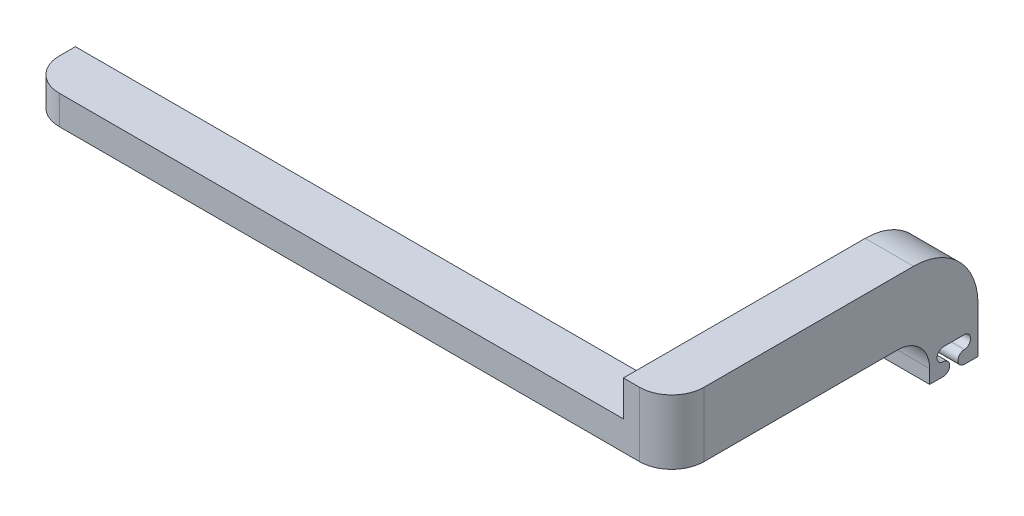
ISO-10303-21;
HEADER;
FILE_DESCRIPTION(('STEP AP214'),'2;1');
FILE_NAME('part.step','',(''),(''),'','','');
FILE_SCHEMA(('AUTOMOTIVE_DESIGN { 1 0 10303 214 1 1 1 1 }'));
ENDSEC;
DATA;
#1=APPLICATION_CONTEXT('core data for automotive mechanical design processes');
#2=APPLICATION_PROTOCOL_DEFINITION('international standard','automotive_design',2000,#1);
#3=PRODUCT_CONTEXT('',#1,'mechanical');
#4=PRODUCT('Part','Part','',(#3));
#5=PRODUCT_RELATED_PRODUCT_CATEGORY('part','',(#4));
#6=PRODUCT_DEFINITION_FORMATION('','',#4);
#7=PRODUCT_DEFINITION_CONTEXT('part definition',#1,'design');
#8=PRODUCT_DEFINITION('design','',#6,#7);
#9=PRODUCT_DEFINITION_SHAPE('','',#8);
#10=(LENGTH_UNIT() NAMED_UNIT(*) SI_UNIT(.MILLI.,.METRE.));
#11=(NAMED_UNIT(*) PLANE_ANGLE_UNIT() SI_UNIT($,.RADIAN.));
#12=(NAMED_UNIT(*) SI_UNIT($,.STERADIAN.) SOLID_ANGLE_UNIT());
#13=UNCERTAINTY_MEASURE_WITH_UNIT(LENGTH_MEASURE(1.E-05),#10,'distance_accuracy_value','');
#14=(GEOMETRIC_REPRESENTATION_CONTEXT(3) GLOBAL_UNCERTAINTY_ASSIGNED_CONTEXT((#13)) GLOBAL_UNIT_ASSIGNED_CONTEXT((#10,
#11,#12)) REPRESENTATION_CONTEXT('',''));
#15=CARTESIAN_POINT('',(0.,0.,0.));
#16=DIRECTION('',(0.,0.,1.));
#17=DIRECTION('',(1.,0.,0.));
#18=AXIS2_PLACEMENT_3D('',#15,#16,#17);
#19=CARTESIAN_POINT('',(-43.083100559231,-15.6274777520744,81.25));
#20=DIRECTION('',(0.,1.,0.));
#21=DIRECTION('',(0.,0.,-1.));
#22=AXIS2_PLACEMENT_3D('',#19,#20,#21);
#23=CYLINDRICAL_SURFACE('',#22,5.);
#24=CARTESIAN_POINT('',(-43.083100559231,-25.6274777520744,81.25));
#25=DIRECTION('',(0.,1.,0.));
#26=DIRECTION('',(0.,0.,1.));
#27=AXIS2_PLACEMENT_3D('',#24,#25,#26);
#28=CIRCLE('',#27,5.);
#29=CARTESIAN_POINT('',(-48.083100559231,-25.6274777520744,81.25));
#30=VERTEX_POINT('',#29);
#31=CARTESIAN_POINT('',(-43.083100559231,-25.6274777520744,86.25));
#32=VERTEX_POINT('',#31);
#33=EDGE_CURVE('E346',#30,#32,#28,.T.);
#34=ORIENTED_EDGE('',*,*,#33,.T.);
#35=DIRECTION('',(0.,1.,0.));
#36=VECTOR('',#35,1.);
#37=CARTESIAN_POINT('',(-43.083100559231,-15.6274777520744,86.25));
#38=LINE('',#37,#36);
#39=CARTESIAN_POINT('',(-43.083100559231,-21.1274777520744,86.25));
#40=VERTEX_POINT('',#39);
#41=EDGE_CURVE('E326',#32,#40,#38,.T.);
#42=ORIENTED_EDGE('',*,*,#41,.T.);
#43=CARTESIAN_POINT('',(-43.083100559231,-21.1274777520744,81.25));
#44=DIRECTION('',(0.,-1.,0.));
#45=DIRECTION('',(0.,0.,-1.));
#46=AXIS2_PLACEMENT_3D('',#43,#44,#45);
#47=CIRCLE('',#46,5.);
#48=CARTESIAN_POINT('',(-48.083100559231,-21.1274777520744,81.25));
#49=VERTEX_POINT('',#48);
#50=EDGE_CURVE('E330',#40,#49,#47,.T.);
#51=ORIENTED_EDGE('',*,*,#50,.T.);
#52=DIRECTION('',(0.,1.,0.));
#53=VECTOR('',#52,1.);
#54=CARTESIAN_POINT('',(-48.083100559231,-21.1274777520744,81.25));
#55=LINE('',#54,#53);
#56=EDGE_CURVE('E334',#49,#30,#55,.F.);
#57=ORIENTED_EDGE('',*,*,#56,.T.);
#58=EDGE_LOOP('',(#34,#42,#51,#57));
#59=FACE_BOUND('',#58,.T.);
#60=ADVANCED_FACE('F43',(#59),#23,.T.);
#61=CARTESIAN_POINT('',(-48.083100559231,-21.1274777520744,78.75));
#62=DIRECTION('',(-1.,0.,0.));
#63=DIRECTION('',(0.,0.,-1.));
#64=AXIS2_PLACEMENT_3D('',#61,#62,#63);
#65=PLANE('',#64);
#66=DIRECTION('',(0.,0.,1.));
#67=VECTOR('',#66,1.);
#68=CARTESIAN_POINT('',(-48.083100559231,-21.1274777520744,78.75));
#69=LINE('',#68,#67);
#70=CARTESIAN_POINT('',(-48.083100559231,-21.1274777520744,78.75));
#71=VERTEX_POINT('',#70);
#72=EDGE_CURVE('E267',#71,#49,#69,.T.);
#73=ORIENTED_EDGE('',*,*,#72,.F.);
#74=DIRECTION('',(0.,1.,0.));
#75=VECTOR('',#74,1.);
#76=CARTESIAN_POINT('',(-48.083100559231,-21.1274777520744,78.75));
#77=LINE('',#76,#75);
#78=CARTESIAN_POINT('',(-48.083100559231,-25.6274777520744,78.75));
#79=VERTEX_POINT('',#78);
#80=EDGE_CURVE('E250',#79,#71,#77,.T.);
#81=ORIENTED_EDGE('',*,*,#80,.F.);
#82=DIRECTION('',(0.,0.,1.));
#83=VECTOR('',#82,1.);
#84=CARTESIAN_POINT('',(-48.083100559231,-25.6274777520744,78.75));
#85=LINE('',#84,#83);
#86=EDGE_CURVE('E258',#79,#30,#85,.T.);
#87=ORIENTED_EDGE('',*,*,#86,.T.);
#88=ORIENTED_EDGE('',*,*,#56,.F.);
#89=EDGE_LOOP('',(#73,#81,#87,#88));
#90=FACE_BOUND('',#89,.T.);
#91=ADVANCED_FACE('F437',(#90),#65,.T.);
#92=CARTESIAN_POINT('',(0.,0.,78.75));
#93=DIRECTION('',(0.,0.,1.));
#94=DIRECTION('',(0.,1.,0.));
#95=AXIS2_PLACEMENT_3D('',#92,#93,#94);
#96=PLANE('',#95);
#97=DIRECTION('',(0.,-1.,0.));
#98=VECTOR('',#97,1.);
#99=CARTESIAN_POINT('',(44.416899440769,-21.1274777520744,78.75));
#100=LINE('',#99,#98);
#101=CARTESIAN_POINT('',(44.416899440769,-21.1274777520744,78.75));
#102=VERTEX_POINT('',#101);
#103=CARTESIAN_POINT('',(44.416899440769,-25.6274777520744,78.75));
#104=VERTEX_POINT('',#103);
#105=EDGE_CURVE('E243',#102,#104,#100,.T.);
#106=ORIENTED_EDGE('',*,*,#105,.T.);
#107=DIRECTION('',(-1.,0.,0.));
#108=VECTOR('',#107,1.);
#109=CARTESIAN_POINT('',(44.416899440769,-25.6274777520744,78.75));
#110=LINE('',#109,#108);
#111=EDGE_CURVE('E247',#104,#79,#110,.T.);
#112=ORIENTED_EDGE('',*,*,#111,.T.);
#113=ORIENTED_EDGE('',*,*,#80,.T.);
#114=DIRECTION('',(1.,0.,0.));
#115=VECTOR('',#114,1.);
#116=CARTESIAN_POINT('',(44.416899440769,-21.1274777520744,78.75));
#117=LINE('',#116,#115);
#118=EDGE_CURVE('E254',#71,#102,#117,.T.);
#119=ORIENTED_EDGE('',*,*,#118,.T.);
#120=EDGE_LOOP('',(#106,#112,#113,#119));
#121=FACE_BOUND('',#120,.T.);
#122=ADVANCED_FACE('F443',(#121),#96,.F.);
#123=CARTESIAN_POINT('',(44.416899440769,-21.1274777520744,78.75));
#124=DIRECTION('',(0.,1.,0.));
#125=DIRECTION('',(0.,0.,-1.));
#126=AXIS2_PLACEMENT_3D('',#123,#124,#125);
#127=PLANE('',#126);
#128=DIRECTION('',(1.,0.,0.));
#129=VECTOR('',#128,1.);
#130=CARTESIAN_POINT('',(44.416899440769,-21.1274777520744,86.25));
#131=LINE('',#130,#129);
#132=CARTESIAN_POINT('',(44.416899440769,-21.1274777520744,86.25));
#133=VERTEX_POINT('',#132);
#134=EDGE_CURVE('E242',#40,#133,#131,.T.);
#135=ORIENTED_EDGE('',*,*,#134,.T.);
#136=DIRECTION('',(0.,0.,1.));
#137=VECTOR('',#136,1.);
#138=CARTESIAN_POINT('',(44.416899440769,-21.1274777520744,78.75));
#139=LINE('',#138,#137);
#140=EDGE_CURVE('E262',#102,#133,#139,.T.);
#141=ORIENTED_EDGE('',*,*,#140,.F.);
#142=ORIENTED_EDGE('',*,*,#118,.F.);
#143=ORIENTED_EDGE('',*,*,#72,.T.);
#144=ORIENTED_EDGE('',*,*,#50,.F.);
#145=EDGE_LOOP('',(#135,#141,#142,#143,#144));
#146=FACE_BOUND('',#145,.T.);
#147=ADVANCED_FACE('F459',(#146),#127,.T.);
#148=CARTESIAN_POINT('',(44.416899440769,-15.6274777520744,86.25));
#149=DIRECTION('',(0.,0.,1.));
#150=DIRECTION('',(0.,1.,0.));
#151=AXIS2_PLACEMENT_3D('',#148,#149,#150);
#152=PLANE('',#151);
#153=DIRECTION('',(1.,0.,0.));
#154=VECTOR('',#153,1.);
#155=CARTESIAN_POINT('',(44.416899440769,-25.6274777520744,86.25));
#156=LINE('',#155,#154);
#157=CARTESIAN_POINT('',(46.916899440769,-25.6274777520744,86.25));
#158=VERTEX_POINT('',#157);
#159=EDGE_CURVE('E279',#32,#158,#156,.T.);
#160=ORIENTED_EDGE('',*,*,#159,.T.);
#161=DIRECTION('',(0.,1.,0.));
#162=VECTOR('',#161,1.);
#163=CARTESIAN_POINT('',(46.916899440769,-25.6274777520744,86.25));
#164=LINE('',#163,#162);
#165=CARTESIAN_POINT('',(46.916899440769,-15.6274777520744,86.25));
#166=VERTEX_POINT('',#165);
#167=EDGE_CURVE('E322',#166,#158,#164,.F.);
#168=ORIENTED_EDGE('',*,*,#167,.F.);
#169=DIRECTION('',(1.,0.,0.));
#170=VECTOR('',#169,1.);
#171=CARTESIAN_POINT('',(44.416899440769,-15.6274777520744,86.25));
#172=LINE('',#171,#170);
#173=CARTESIAN_POINT('',(44.416899440769,-15.6274777520744,86.25));
#174=VERTEX_POINT('',#173);
#175=EDGE_CURVE('E282',#174,#166,#172,.T.);
#176=ORIENTED_EDGE('',*,*,#175,.F.);
#177=DIRECTION('',(0.,1.,0.));
#178=VECTOR('',#177,1.);
#179=CARTESIAN_POINT('',(44.416899440769,-15.6274777520744,86.25));
#180=LINE('',#179,#178);
#181=EDGE_CURVE('E275',#133,#174,#180,.T.);
#182=ORIENTED_EDGE('',*,*,#181,.F.);
#183=ORIENTED_EDGE('',*,*,#134,.F.);
#184=ORIENTED_EDGE('',*,*,#41,.F.);
#185=EDGE_LOOP('',(#160,#168,#176,#182,#183,#184));
#186=FACE_BOUND('',#185,.T.);
#187=ADVANCED_FACE('F454',(#186),#152,.T.);
#188=CARTESIAN_POINT('',(0.,-15.6274777520744,38.75));
#189=DIRECTION('',(0.,-1.,0.));
#190=DIRECTION('',(1.,0.,0.));
#191=AXIS2_PLACEMENT_3D('',#188,#189,#190);
#192=PLANE('',#191);
#193=DIRECTION('',(0.,0.,1.));
#194=VECTOR('',#193,1.);
#195=CARTESIAN_POINT('',(51.916899440769,-15.6274777520745,38.75));
#196=LINE('',#195,#194);
#197=CARTESIAN_POINT('',(51.916899440769,-15.6274777520745,48.75));
#198=VERTEX_POINT('',#197);
#199=CARTESIAN_POINT('',(51.916899440769,-15.6274777520745,81.25));
#200=VERTEX_POINT('',#199);
#201=EDGE_CURVE('E303',#198,#200,#196,.T.);
#202=ORIENTED_EDGE('',*,*,#201,.F.);
#203=DIRECTION('',(-1.,0.,0.));
#204=VECTOR('',#203,1.);
#205=CARTESIAN_POINT('',(51.916899440769,-15.6274777520745,48.75));
#206=LINE('',#205,#204);
#207=CARTESIAN_POINT('',(44.416899440769,-15.6274777520744,48.75));
#208=VERTEX_POINT('',#207);
#209=EDGE_CURVE('E314',#208,#198,#206,.F.);
#210=ORIENTED_EDGE('',*,*,#209,.F.);
#211=DIRECTION('',(0.,0.,1.));
#212=VECTOR('',#211,1.);
#213=CARTESIAN_POINT('',(44.416899440769,-15.6274777520744,38.75));
#214=LINE('',#213,#212);
#215=EDGE_CURVE('E296',#208,#174,#214,.T.);
#216=ORIENTED_EDGE('',*,*,#215,.T.);
#217=ORIENTED_EDGE('',*,*,#175,.T.);
#218=CARTESIAN_POINT('',(46.916899440769,-15.6274777520744,81.25));
#219=DIRECTION('',(0.,1.,0.));
#220=DIRECTION('',(1.,0.,0.));
#221=AXIS2_PLACEMENT_3D('',#218,#219,#220);
#222=CIRCLE('',#221,5.);
#223=EDGE_CURVE('E353',#200,#166,#222,.F.);
#224=ORIENTED_EDGE('',*,*,#223,.F.);
#225=EDGE_LOOP('',(#202,#210,#216,#217,#224));
#226=FACE_BOUND('',#225,.T.);
#227=ADVANCED_FACE('F410',(#226),#192,.F.);
#228=CARTESIAN_POINT('',(46.916899440769,0.,81.25));
#229=DIRECTION('',(0.,-1.,0.));
#230=DIRECTION('',(0.,0.,1.));
#231=AXIS2_PLACEMENT_3D('',#228,#229,#230);
#232=CYLINDRICAL_SURFACE('',#231,5.);
#233=CARTESIAN_POINT('',(46.916899440769,-25.6274777520744,81.25));
#234=DIRECTION('',(0.,1.,0.));
#235=DIRECTION('',(0.,0.,1.));
#236=AXIS2_PLACEMENT_3D('',#233,#234,#235);
#237=CIRCLE('',#236,5.);
#238=CARTESIAN_POINT('',(51.916899440769,-25.6274777520744,81.25));
#239=VERTEX_POINT('',#238);
#240=EDGE_CURVE('E342',#158,#239,#237,.T.);
#241=ORIENTED_EDGE('',*,*,#240,.T.);
#242=DIRECTION('',(0.,1.,0.));
#243=VECTOR('',#242,1.);
#244=CARTESIAN_POINT('',(51.916899440769,-15.6274777520744,81.25));
#245=LINE('',#244,#243);
#246=EDGE_CURVE('E350',#239,#200,#245,.T.);
#247=ORIENTED_EDGE('',*,*,#246,.T.);
#248=ORIENTED_EDGE('',*,*,#223,.T.);
#249=ORIENTED_EDGE('',*,*,#167,.T.);
#250=EDGE_LOOP('',(#241,#247,#248,#249));
#251=FACE_BOUND('',#250,.T.);
#252=ADVANCED_FACE('F414',(#251),#232,.T.);
#253=CARTESIAN_POINT('',(44.416899440769,-25.6274777520744,46.25));
#254=DIRECTION('',(0.,-1.,0.));
#255=DIRECTION('',(0.,0.,1.));
#256=AXIS2_PLACEMENT_3D('',#253,#254,#255);
#257=PLANE('',#256);
#258=ORIENTED_EDGE('',*,*,#86,.F.);
#259=ORIENTED_EDGE('',*,*,#111,.F.);
#260=DIRECTION('',(0.,0.,1.));
#261=VECTOR('',#260,1.);
#262=CARTESIAN_POINT('',(44.416899440769,-25.6274777520744,46.25));
#263=LINE('',#262,#261);
#264=CARTESIAN_POINT('',(44.416899440769,-25.6274777520744,51.25));
#265=VERTEX_POINT('',#264);
#266=EDGE_CURVE('E272',#265,#104,#263,.T.);
#267=ORIENTED_EDGE('',*,*,#266,.F.);
#268=DIRECTION('',(1.,0.,0.));
#269=VECTOR('',#268,1.);
#270=CARTESIAN_POINT('',(44.416899440769,-25.6274777520744,51.25));
#271=LINE('',#270,#269);
#272=CARTESIAN_POINT('',(51.916899440769,-25.6274777520744,51.25));
#273=VERTEX_POINT('',#272);
#274=EDGE_CURVE('E338',#273,#265,#271,.F.);
#275=ORIENTED_EDGE('',*,*,#274,.F.);
#276=DIRECTION('',(0.,0.,1.));
#277=VECTOR('',#276,1.);
#278=CARTESIAN_POINT('',(51.916899440769,-25.6274777520744,46.25));
#279=LINE('',#278,#277);
#280=EDGE_CURVE('E266',#273,#239,#279,.T.);
#281=ORIENTED_EDGE('',*,*,#280,.T.);
#282=ORIENTED_EDGE('',*,*,#240,.F.);
#283=ORIENTED_EDGE('',*,*,#159,.F.);
#284=ORIENTED_EDGE('',*,*,#33,.F.);
#285=EDGE_LOOP('',(#258,#259,#267,#275,#281,#282,#283,#284));
#286=FACE_BOUND('',#285,.T.);
#287=ADVANCED_FACE('F421',(#286),#257,.T.);
#288=CARTESIAN_POINT('',(0.,-25.6274777520744,48.75));
#289=DIRECTION('',(1.,0.,0.));
#290=DIRECTION('',(0.,1.,0.));
#291=AXIS2_PLACEMENT_3D('',#288,#289,#290);
#292=CYLINDRICAL_SURFACE('',#291,10.);
#293=CARTESIAN_POINT('',(51.916899440769,-25.6274777520745,48.75));
#294=DIRECTION('',(1.,0.,0.));
#295=DIRECTION('',(0.,0.,-1.));
#296=AXIS2_PLACEMENT_3D('',#293,#294,#295);
#297=CIRCLE('',#296,10.);
#298=CARTESIAN_POINT('',(51.916899440769,-25.6274777520745,38.75));
#299=VERTEX_POINT('',#298);
#300=EDGE_CURVE('E318',#198,#299,#297,.F.);
#301=ORIENTED_EDGE('',*,*,#300,.T.);
#302=DIRECTION('',(-1.,0.,0.));
#303=VECTOR('',#302,1.);
#304=CARTESIAN_POINT('',(44.4168994407689,-25.6274777520744,38.75));
#305=LINE('',#304,#303);
#306=CARTESIAN_POINT('',(44.416899440769,-25.6274777520744,38.75));
#307=VERTEX_POINT('',#306);
#308=EDGE_CURVE('E307',#299,#307,#305,.T.);
#309=ORIENTED_EDGE('',*,*,#308,.T.);
#310=CARTESIAN_POINT('',(44.416899440769,-25.6274777520744,48.75));
#311=DIRECTION('',(1.,0.,0.));
#312=DIRECTION('',(0.,-1.,0.));
#313=AXIS2_PLACEMENT_3D('',#310,#311,#312);
#314=CIRCLE('',#313,10.);
#315=EDGE_CURVE('E311',#307,#208,#314,.T.);
#316=ORIENTED_EDGE('',*,*,#315,.T.);
#317=ORIENTED_EDGE('',*,*,#209,.T.);
#318=EDGE_LOOP('',(#301,#309,#316,#317));
#319=FACE_BOUND('',#318,.T.);
#320=ADVANCED_FACE('F405',(#319),#292,.T.);
#321=CARTESIAN_POINT('',(0.,-30.6274777520744,51.25));
#322=DIRECTION('',(1.,0.,0.));
#323=DIRECTION('',(0.,0.,1.));
#324=AXIS2_PLACEMENT_3D('',#321,#322,#323);
#325=CYLINDRICAL_SURFACE('',#324,5.);
#326=CARTESIAN_POINT('',(44.416899440769,-30.6274777520744,51.25));
#327=DIRECTION('',(1.,0.,0.));
#328=DIRECTION('',(0.,-1.,0.));
#329=AXIS2_PLACEMENT_3D('',#326,#327,#328);
#330=CIRCLE('',#329,5.);
#331=CARTESIAN_POINT('',(44.416899440769,-30.6274777520744,46.25));
#332=VERTEX_POINT('',#331);
#333=EDGE_CURVE('E363',#265,#332,#330,.F.);
#334=ORIENTED_EDGE('',*,*,#333,.T.);
#335=DIRECTION('',(1.,0.,0.));
#336=VECTOR('',#335,1.);
#337=CARTESIAN_POINT('',(0.,-30.6274777520744,46.25));
#338=LINE('',#337,#336);
#339=CARTESIAN_POINT('',(51.916899440769,-30.6274777520744,46.25));
#340=VERTEX_POINT('',#339);
#341=EDGE_CURVE('E356',#332,#340,#338,.T.);
#342=ORIENTED_EDGE('',*,*,#341,.T.);
#343=CARTESIAN_POINT('',(51.916899440769,-30.6274777520744,51.25));
#344=DIRECTION('',(1.,0.,0.));
#345=DIRECTION('',(0.,0.,-1.));
#346=AXIS2_PLACEMENT_3D('',#343,#344,#345);
#347=CIRCLE('',#346,5.);
#348=EDGE_CURVE('E360',#340,#273,#347,.T.);
#349=ORIENTED_EDGE('',*,*,#348,.T.);
#350=ORIENTED_EDGE('',*,*,#274,.T.);
#351=EDGE_LOOP('',(#334,#342,#349,#350));
#352=FACE_BOUND('',#351,.T.);
#353=ADVANCED_FACE('F45',(#352),#325,.F.);
#354=CARTESIAN_POINT('',(0.,0.,38.75));
#355=DIRECTION('',(0.,0.,-1.));
#356=DIRECTION('',(1.,0.,0.));
#357=AXIS2_PLACEMENT_3D('',#354,#355,#356);
#358=PLANE('',#357);
#359=DIRECTION('',(0.,1.,0.));
#360=VECTOR('',#359,1.);
#361=CARTESIAN_POINT('',(44.4168994407689,0.,38.75));
#362=LINE('',#361,#360);
#363=CARTESIAN_POINT('',(44.416899440769,-32.7524777520744,38.75));
#364=VERTEX_POINT('',#363);
#365=EDGE_CURVE('E289',#364,#307,#362,.T.);
#366=ORIENTED_EDGE('',*,*,#365,.T.);
#367=ORIENTED_EDGE('',*,*,#308,.F.);
#368=DIRECTION('',(0.,1.,0.));
#369=VECTOR('',#368,1.);
#370=CARTESIAN_POINT('',(51.916899440769,0.,38.75));
#371=LINE('',#370,#369);
#372=CARTESIAN_POINT('',(51.916899440769,-32.7524777520744,38.75));
#373=VERTEX_POINT('',#372);
#374=EDGE_CURVE('E292',#373,#299,#371,.T.);
#375=ORIENTED_EDGE('',*,*,#374,.F.);
#376=DIRECTION('',(-1.,0.,0.));
#377=VECTOR('',#376,1.);
#378=CARTESIAN_POINT('',(54.416899440769,-32.7524777520744,38.75));
#379=LINE('',#378,#377);
#380=EDGE_CURVE('E219',#373,#364,#379,.T.);
#381=ORIENTED_EDGE('',*,*,#380,.T.);
#382=EDGE_LOOP('',(#366,#367,#375,#381));
#383=FACE_BOUND('',#382,.T.);
#384=ADVANCED_FACE('F400',(#383),#358,.T.);
#385=CARTESIAN_POINT('',(0.,0.,46.25));
#386=DIRECTION('',(0.,0.,-1.));
#387=DIRECTION('',(1.,0.,0.));
#388=AXIS2_PLACEMENT_3D('',#385,#386,#387);
#389=PLANE('',#388);
#390=DIRECTION('',(0.,1.,0.));
#391=VECTOR('',#390,1.);
#392=CARTESIAN_POINT('',(51.916899440769,0.,46.25));
#393=LINE('',#392,#391);
#394=CARTESIAN_POINT('',(51.916899440769,-32.7524777520744,46.25));
#395=VERTEX_POINT('',#394);
#396=EDGE_CURVE('E293',#395,#340,#393,.T.);
#397=ORIENTED_EDGE('',*,*,#396,.T.);
#398=ORIENTED_EDGE('',*,*,#341,.F.);
#399=DIRECTION('',(0.,1.,0.));
#400=VECTOR('',#399,1.);
#401=CARTESIAN_POINT('',(44.4168994407689,0.,46.25));
#402=LINE('',#401,#400);
#403=CARTESIAN_POINT('',(44.416899440769,-32.7524777520744,46.25));
#404=VERTEX_POINT('',#403);
#405=EDGE_CURVE('E64',#404,#332,#402,.T.);
#406=ORIENTED_EDGE('',*,*,#405,.F.);
#407=DIRECTION('',(-1.,0.,0.));
#408=VECTOR('',#407,1.);
#409=CARTESIAN_POINT('',(54.416899440769,-32.7524777520744,46.25));
#410=LINE('',#409,#408);
#411=EDGE_CURVE('E223',#395,#404,#410,.T.);
#412=ORIENTED_EDGE('',*,*,#411,.F.);
#413=EDGE_LOOP('',(#397,#398,#406,#412));
#414=FACE_BOUND('',#413,.T.);
#415=ADVANCED_FACE('F425',(#414),#389,.F.);
#416=CARTESIAN_POINT('',(51.916899440769,0.,38.75));
#417=DIRECTION('',(-1.,0.,0.));
#418=DIRECTION('',(0.,0.,-1.));
#419=AXIS2_PLACEMENT_3D('',#416,#417,#418);
#420=PLANE('',#419);
#421=DIRECTION('',(0.,0.,-1.));
#422=VECTOR('',#421,1.);
#423=CARTESIAN_POINT('',(51.916899440769,-32.7524777520744,38.75));
#424=LINE('',#423,#422);
#425=CARTESIAN_POINT('',(51.916899440769,-32.7524777520744,40.8584542144866));
#426=VERTEX_POINT('',#425);
#427=EDGE_CURVE('E239',#426,#373,#424,.T.);
#428=ORIENTED_EDGE('',*,*,#427,.T.);
#429=ORIENTED_EDGE('',*,*,#374,.T.);
#430=ORIENTED_EDGE('',*,*,#300,.F.);
#431=ORIENTED_EDGE('',*,*,#201,.T.);
#432=ORIENTED_EDGE('',*,*,#246,.F.);
#433=ORIENTED_EDGE('',*,*,#280,.F.);
#434=ORIENTED_EDGE('',*,*,#348,.F.);
#435=ORIENTED_EDGE('',*,*,#396,.F.);
#436=DIRECTION('',(0.,0.,1.));
#437=VECTOR('',#436,1.);
#438=CARTESIAN_POINT('',(51.916899440769,-32.7524777520744,38.75));
#439=LINE('',#438,#437);
#440=CARTESIAN_POINT('',(51.916899440769,-32.7524777520744,44.1415457855134));
#441=VERTEX_POINT('',#440);
#442=EDGE_CURVE('E218',#441,#395,#439,.T.);
#443=ORIENTED_EDGE('',*,*,#442,.F.);
#444=CARTESIAN_POINT('',(51.916899440769,-31.7524777520744,44.1415457855134));
#445=DIRECTION('',(1.,0.,0.));
#446=DIRECTION('',(0.,0.,-1.));
#447=AXIS2_PLACEMENT_3D('',#444,#445,#446);
#448=CIRCLE('',#447,1.);
#449=CARTESIAN_POINT('',(51.916899440769,-30.7524777520744,44.1415457855134));
#450=VERTEX_POINT('',#449);
#451=EDGE_CURVE('E52',#441,#450,#448,.T.);
#452=ORIENTED_EDGE('',*,*,#451,.T.);
#453=CARTESIAN_POINT('',(51.916899440769,-29.7524777520744,44.0972525977368));
#454=DIRECTION('',(1.,0.,0.));
#455=DIRECTION('',(0.,0.,-1.));
#456=AXIS2_PLACEMENT_3D('',#453,#454,#455);
#457=CIRCLE('',#456,1.00098046258827);
#458=CARTESIAN_POINT('',(51.916899440769,-28.7524777520744,44.1415457855134));
#459=VERTEX_POINT('',#458);
#460=EDGE_CURVE('E374',#450,#459,#457,.F.);
#461=ORIENTED_EDGE('',*,*,#460,.T.);
#462=DIRECTION('',(0.,0.,-1.));
#463=VECTOR('',#462,1.);
#464=CARTESIAN_POINT('',(51.916899440769,-28.7524777520744,38.75));
#465=LINE('',#464,#463);
#466=CARTESIAN_POINT('',(51.916899440769,-28.7524777520744,40.8584542144866));
#467=VERTEX_POINT('',#466);
#468=EDGE_CURVE('E370',#459,#467,#465,.T.);
#469=ORIENTED_EDGE('',*,*,#468,.T.);
#470=CARTESIAN_POINT('',(51.916899440769,-29.7524777520744,40.9027474022632));
#471=DIRECTION('',(1.,0.,0.));
#472=DIRECTION('',(0.,0.,-1.));
#473=AXIS2_PLACEMENT_3D('',#470,#471,#472);
#474=CIRCLE('',#473,1.00098046258827);
#475=CARTESIAN_POINT('',(51.916899440769,-30.7524777520744,40.8584542144866));
#476=VERTEX_POINT('',#475);
#477=EDGE_CURVE('E367',#476,#467,#474,.T.);
#478=ORIENTED_EDGE('',*,*,#477,.F.);
#479=CARTESIAN_POINT('',(51.916899440769,-31.7524777520744,40.8584542144866));
#480=DIRECTION('',(1.,0.,0.));
#481=DIRECTION('',(0.,0.,-1.));
#482=AXIS2_PLACEMENT_3D('',#479,#480,#481);
#483=CIRCLE('',#482,1.);
#484=EDGE_CURVE('E11',#426,#476,#483,.F.);
#485=ORIENTED_EDGE('',*,*,#484,.F.);
#486=EDGE_LOOP('',(#428,#429,#430,#431,#432,#433,#434,#435,#443,#452,#461,#469,#478,#485));
#487=FACE_BOUND('',#486,.T.);
#488=ADVANCED_FACE('F382',(#487),#420,.F.);
#489=CARTESIAN_POINT('',(44.4168994407689,0.,38.75));
#490=DIRECTION('',(-1.,0.,0.));
#491=DIRECTION('',(0.,-1.,0.));
#492=AXIS2_PLACEMENT_3D('',#489,#490,#491);
#493=PLANE('',#492);
#494=CARTESIAN_POINT('',(44.416899440769,-31.7524777520744,40.8584542144866));
#495=DIRECTION('',(1.,0.,0.));
#496=DIRECTION('',(0.,-1.,0.));
#497=AXIS2_PLACEMENT_3D('',#494,#495,#496);
#498=CIRCLE('',#497,1.);
#499=CARTESIAN_POINT('',(44.416899440769,-32.7524777520744,40.8584542144866));
#500=VERTEX_POINT('',#499);
#501=CARTESIAN_POINT('',(44.416899440769,-30.7524777520744,40.8584542144866));
#502=VERTEX_POINT('',#501);
#503=EDGE_CURVE('E178',#500,#502,#498,.F.);
#504=ORIENTED_EDGE('',*,*,#503,.T.);
#505=CARTESIAN_POINT('',(44.416899440769,-29.7524777520744,40.9027474022632));
#506=DIRECTION('',(1.,0.,0.));
#507=DIRECTION('',(0.,-1.,0.));
#508=AXIS2_PLACEMENT_3D('',#505,#506,#507);
#509=CIRCLE('',#508,1.00098046258827);
#510=CARTESIAN_POINT('',(44.416899440769,-28.7524777520744,40.8584542144866));
#511=VERTEX_POINT('',#510);
#512=EDGE_CURVE('E188',#502,#511,#509,.T.);
#513=ORIENTED_EDGE('',*,*,#512,.T.);
#514=DIRECTION('',(0.,0.,-1.));
#515=VECTOR('',#514,1.);
#516=CARTESIAN_POINT('',(44.416899440769,-28.7524777520744,50.));
#517=LINE('',#516,#515);
#518=CARTESIAN_POINT('',(44.416899440769,-28.7524777520744,44.1415457855134));
#519=VERTEX_POINT('',#518);
#520=EDGE_CURVE('E193',#519,#511,#517,.T.);
#521=ORIENTED_EDGE('',*,*,#520,.F.);
#522=CARTESIAN_POINT('',(44.416899440769,-29.7524777520744,44.0972525977368));
#523=DIRECTION('',(1.,0.,0.));
#524=DIRECTION('',(0.,-1.,0.));
#525=AXIS2_PLACEMENT_3D('',#522,#523,#524);
#526=CIRCLE('',#525,1.00098046258827);
#527=CARTESIAN_POINT('',(44.416899440769,-30.7524777520744,44.1415457855134));
#528=VERTEX_POINT('',#527);
#529=EDGE_CURVE('E203',#528,#519,#526,.F.);
#530=ORIENTED_EDGE('',*,*,#529,.F.);
#531=CARTESIAN_POINT('',(44.416899440769,-31.7524777520744,44.1415457855134));
#532=DIRECTION('',(1.,0.,0.));
#533=DIRECTION('',(0.,-1.,0.));
#534=AXIS2_PLACEMENT_3D('',#531,#532,#533);
#535=CIRCLE('',#534,1.);
#536=CARTESIAN_POINT('',(44.416899440769,-32.7524777520744,44.1415457855134));
#537=VERTEX_POINT('',#536);
#538=EDGE_CURVE('E207',#537,#528,#535,.T.);
#539=ORIENTED_EDGE('',*,*,#538,.F.);
#540=DIRECTION('',(0.,0.,1.));
#541=VECTOR('',#540,1.);
#542=CARTESIAN_POINT('',(44.416899440769,-32.7524777520744,50.));
#543=LINE('',#542,#541);
#544=EDGE_CURVE('E59',#537,#404,#543,.T.);
#545=ORIENTED_EDGE('',*,*,#544,.T.);
#546=ORIENTED_EDGE('',*,*,#405,.T.);
#547=ORIENTED_EDGE('',*,*,#333,.F.);
#548=ORIENTED_EDGE('',*,*,#266,.T.);
#549=ORIENTED_EDGE('',*,*,#105,.F.);
#550=ORIENTED_EDGE('',*,*,#140,.T.);
#551=ORIENTED_EDGE('',*,*,#181,.T.);
#552=ORIENTED_EDGE('',*,*,#215,.F.);
#553=ORIENTED_EDGE('',*,*,#315,.F.);
#554=ORIENTED_EDGE('',*,*,#365,.F.);
#555=DIRECTION('',(0.,0.,-1.));
#556=VECTOR('',#555,1.);
#557=CARTESIAN_POINT('',(44.416899440769,-32.7524777520744,50.));
#558=LINE('',#557,#556);
#559=EDGE_CURVE('E185',#500,#364,#558,.T.);
#560=ORIENTED_EDGE('',*,*,#559,.F.);
#561=EDGE_LOOP('',(#504,#513,#521,#530,#539,#545,#546,#547,#548,#549,#550,#551,#552,#553,#554,#560));
#562=FACE_BOUND('',#561,.T.);
#563=ADVANCED_FACE('F196',(#562),#493,.T.);
#564=CARTESIAN_POINT('',(54.416899440769,-31.7524777520744,40.8584542144866));
#565=DIRECTION('',(-1.,0.,0.));
#566=DIRECTION('',(0.,-1.,0.));
#567=AXIS2_PLACEMENT_3D('',#564,#565,#566);
#568=CYLINDRICAL_SURFACE('',#567,1.);
#569=DIRECTION('',(-1.,0.,0.));
#570=VECTOR('',#569,1.);
#571=CARTESIAN_POINT('',(54.416899440769,-32.7524777520744,40.8584542144866));
#572=LINE('',#571,#570);
#573=EDGE_CURVE('E215',#426,#500,#572,.T.);
#574=ORIENTED_EDGE('',*,*,#573,.F.);
#575=ORIENTED_EDGE('',*,*,#484,.T.);
#576=DIRECTION('',(-1.,0.,0.));
#577=VECTOR('',#576,1.);
#578=CARTESIAN_POINT('',(54.416899440769,-30.7524777520744,40.8584542144866));
#579=LINE('',#578,#577);
#580=EDGE_CURVE('E174',#476,#502,#579,.T.);
#581=ORIENTED_EDGE('',*,*,#580,.T.);
#582=ORIENTED_EDGE('',*,*,#503,.F.);
#583=EDGE_LOOP('',(#574,#575,#581,#582));
#584=FACE_BOUND('',#583,.T.);
#585=ADVANCED_FACE('F176',(#584),#568,.T.);
#586=CARTESIAN_POINT('',(54.416899440769,-31.7524777520744,44.1415457855134));
#587=DIRECTION('',(-1.,0.,0.));
#588=DIRECTION('',(0.,-1.,0.));
#589=AXIS2_PLACEMENT_3D('',#586,#587,#588);
#590=CYLINDRICAL_SURFACE('',#589,1.);
#591=ORIENTED_EDGE('',*,*,#451,.F.);
#592=DIRECTION('',(-1.,0.,0.));
#593=VECTOR('',#592,1.);
#594=CARTESIAN_POINT('',(54.416899440769,-32.7524777520744,44.1415457855134));
#595=LINE('',#594,#593);
#596=EDGE_CURVE('E226',#441,#537,#595,.T.);
#597=ORIENTED_EDGE('',*,*,#596,.T.);
#598=ORIENTED_EDGE('',*,*,#538,.T.);
#599=DIRECTION('',(-1.,0.,0.));
#600=VECTOR('',#599,1.);
#601=CARTESIAN_POINT('',(54.416899440769,-30.7524777520744,44.1415457855134));
#602=LINE('',#601,#600);
#603=EDGE_CURVE('E229',#450,#528,#602,.T.);
#604=ORIENTED_EDGE('',*,*,#603,.F.);
#605=EDGE_LOOP('',(#591,#597,#598,#604));
#606=FACE_BOUND('',#605,.T.);
#607=ADVANCED_FACE('F386',(#606),#590,.T.);
#608=CARTESIAN_POINT('',(54.416899440769,-29.7524777520744,44.0972525977368));
#609=DIRECTION('',(-1.,0.,0.));
#610=DIRECTION('',(0.,-1.,0.));
#611=AXIS2_PLACEMENT_3D('',#608,#609,#610);
#612=CYLINDRICAL_SURFACE('',#611,1.00098046258827);
#613=ORIENTED_EDGE('',*,*,#460,.F.);
#614=ORIENTED_EDGE('',*,*,#603,.T.);
#615=ORIENTED_EDGE('',*,*,#529,.T.);
#616=DIRECTION('',(-1.,0.,0.));
#617=VECTOR('',#616,1.);
#618=CARTESIAN_POINT('',(54.416899440769,-28.7524777520744,44.1415457855134));
#619=LINE('',#618,#617);
#620=EDGE_CURVE('E232',#459,#519,#619,.T.);
#621=ORIENTED_EDGE('',*,*,#620,.F.);
#622=EDGE_LOOP('',(#613,#614,#615,#621));
#623=FACE_BOUND('',#622,.T.);
#624=ADVANCED_FACE('F389',(#623),#612,.F.);
#625=CARTESIAN_POINT('',(54.416899440769,-28.7524777520744,50.));
#626=DIRECTION('',(0.,-1.,0.));
#627=DIRECTION('',(1.,0.,0.));
#628=AXIS2_PLACEMENT_3D('',#625,#626,#627);
#629=PLANE('',#628);
#630=ORIENTED_EDGE('',*,*,#468,.F.);
#631=ORIENTED_EDGE('',*,*,#620,.T.);
#632=ORIENTED_EDGE('',*,*,#520,.T.);
#633=DIRECTION('',(-1.,0.,0.));
#634=VECTOR('',#633,1.);
#635=CARTESIAN_POINT('',(54.416899440769,-28.7524777520744,40.8584542144866));
#636=LINE('',#635,#634);
#637=EDGE_CURVE('E184',#467,#511,#636,.T.);
#638=ORIENTED_EDGE('',*,*,#637,.F.);
#639=EDGE_LOOP('',(#630,#631,#632,#638));
#640=FACE_BOUND('',#639,.T.);
#641=ADVANCED_FACE('F392',(#640),#629,.T.);
#642=CARTESIAN_POINT('',(54.416899440769,-29.7524777520744,40.9027474022632));
#643=DIRECTION('',(-1.,0.,0.));
#644=DIRECTION('',(0.,-1.,0.));
#645=AXIS2_PLACEMENT_3D('',#642,#643,#644);
#646=CYLINDRICAL_SURFACE('',#645,1.00098046258827);
#647=ORIENTED_EDGE('',*,*,#580,.F.);
#648=ORIENTED_EDGE('',*,*,#477,.T.);
#649=ORIENTED_EDGE('',*,*,#637,.T.);
#650=ORIENTED_EDGE('',*,*,#512,.F.);
#651=EDGE_LOOP('',(#647,#648,#649,#650));
#652=FACE_BOUND('',#651,.T.);
#653=ADVANCED_FACE('F189',(#652),#646,.F.);
#654=CARTESIAN_POINT('',(54.416899440769,-32.7524777520744,50.));
#655=DIRECTION('',(0.,-1.,0.));
#656=DIRECTION('',(1.,0.,0.));
#657=AXIS2_PLACEMENT_3D('',#654,#655,#656);
#658=PLANE('',#657);
#659=ORIENTED_EDGE('',*,*,#427,.F.);
#660=ORIENTED_EDGE('',*,*,#573,.T.);
#661=ORIENTED_EDGE('',*,*,#559,.T.);
#662=ORIENTED_EDGE('',*,*,#380,.F.);
#663=EDGE_LOOP('',(#659,#660,#661,#662));
#664=FACE_BOUND('',#663,.T.);
#665=ADVANCED_FACE('F396',(#664),#658,.T.);
#666=CARTESIAN_POINT('',(54.416899440769,-32.7524777520744,50.));
#667=DIRECTION('',(0.,1.,0.));
#668=DIRECTION('',(-1.,0.,0.));
#669=AXIS2_PLACEMENT_3D('',#666,#667,#668);
#670=PLANE('',#669);
#671=ORIENTED_EDGE('',*,*,#596,.F.);
#672=ORIENTED_EDGE('',*,*,#442,.T.);
#673=ORIENTED_EDGE('',*,*,#411,.T.);
#674=ORIENTED_EDGE('',*,*,#544,.F.);
#675=EDGE_LOOP('',(#671,#672,#673,#674));
#676=FACE_BOUND('',#675,.T.);
#677=ADVANCED_FACE('F428',(#676),#670,.F.);
#678=CLOSED_SHELL('',(#60,#91,#122,#147,#187,#227,#252,#287,#320,#353,#384,#415,#488,#563,#585,
#607,#624,#641,#653,#665,#677));
#679=MANIFOLD_SOLID_BREP('B2',#678);
#680=ADVANCED_BREP_SHAPE_REPRESENTATION('',(#18,#679),#14);
#681=SHAPE_DEFINITION_REPRESENTATION(#9,#680);
ENDSEC;
END-ISO-10303-21;
